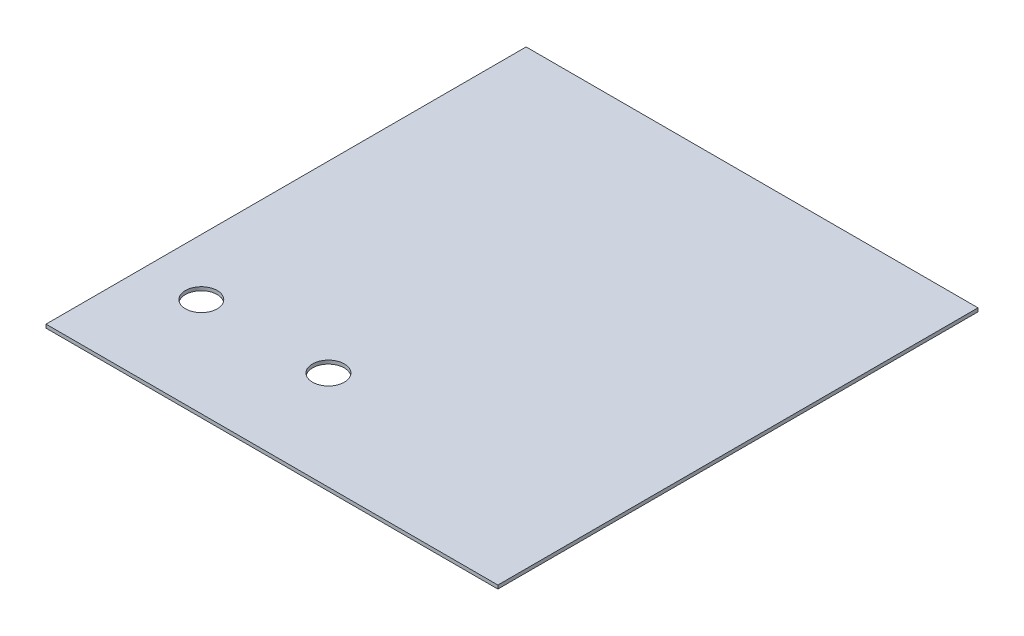
ISO-10303-21;
HEADER;
FILE_DESCRIPTION(('STEP AP214'),'2;1');
FILE_NAME('part.step','',(''),(''),'','','');
FILE_SCHEMA(('AUTOMOTIVE_DESIGN { 1 0 10303 214 1 1 1 1 }'));
ENDSEC;
DATA;
#1=APPLICATION_CONTEXT('core data for automotive mechanical design processes');
#2=APPLICATION_PROTOCOL_DEFINITION('international standard','automotive_design',2000,#1);
#3=PRODUCT_CONTEXT('',#1,'mechanical');
#4=PRODUCT('Part','Part','',(#3));
#5=PRODUCT_RELATED_PRODUCT_CATEGORY('part','',(#4));
#6=PRODUCT_DEFINITION_FORMATION('','',#4);
#7=PRODUCT_DEFINITION_CONTEXT('part definition',#1,'design');
#8=PRODUCT_DEFINITION('design','',#6,#7);
#9=PRODUCT_DEFINITION_SHAPE('','',#8);
#10=(LENGTH_UNIT() NAMED_UNIT(*) SI_UNIT(.MILLI.,.METRE.));
#11=(NAMED_UNIT(*) PLANE_ANGLE_UNIT() SI_UNIT($,.RADIAN.));
#12=(NAMED_UNIT(*) SI_UNIT($,.STERADIAN.) SOLID_ANGLE_UNIT());
#13=UNCERTAINTY_MEASURE_WITH_UNIT(LENGTH_MEASURE(1.E-05),#10,'distance_accuracy_value','');
#14=(GEOMETRIC_REPRESENTATION_CONTEXT(3) GLOBAL_UNCERTAINTY_ASSIGNED_CONTEXT((#13)) GLOBAL_UNIT_ASSIGNED_CONTEXT((#10,
#11,#12)) REPRESENTATION_CONTEXT('',''));
#15=CARTESIAN_POINT('',(0.,0.,0.));
#16=DIRECTION('',(0.,0.,1.));
#17=DIRECTION('',(1.,0.,0.));
#18=AXIS2_PLACEMENT_3D('',#15,#16,#17);
#19=CARTESIAN_POINT('',(0.,3.175,0.));
#20=DIRECTION('',(1.,0.,0.));
#21=DIRECTION('',(0.,0.,-1.));
#22=AXIS2_PLACEMENT_3D('',#19,#20,#21);
#23=PLANE('',#22);
#24=DIRECTION('',(0.,0.,1.));
#25=VECTOR('',#24,1.);
#26=CARTESIAN_POINT('',(0.,0.,0.));
#27=LINE('',#26,#25);
#28=CARTESIAN_POINT('',(0.,0.,-431.8));
#29=VERTEX_POINT('',#28);
#30=CARTESIAN_POINT('',(0.,0.,0.));
#31=VERTEX_POINT('',#30);
#32=EDGE_CURVE('E107',#29,#31,#27,.T.);
#33=ORIENTED_EDGE('',*,*,#32,.T.);
#34=DIRECTION('',(0.,-1.,0.));
#35=VECTOR('',#34,1.);
#36=CARTESIAN_POINT('',(0.,3.175,0.));
#37=LINE('',#36,#35);
#38=CARTESIAN_POINT('',(0.,3.175,0.));
#39=VERTEX_POINT('',#38);
#40=EDGE_CURVE('E11',#39,#31,#37,.T.);
#41=ORIENTED_EDGE('',*,*,#40,.F.);
#42=DIRECTION('',(0.,0.,1.));
#43=VECTOR('',#42,1.);
#44=CARTESIAN_POINT('',(0.,3.175,0.));
#45=LINE('',#44,#43);
#46=CARTESIAN_POINT('',(0.,3.175,-431.8));
#47=VERTEX_POINT('',#46);
#48=EDGE_CURVE('E91',#47,#39,#45,.T.);
#49=ORIENTED_EDGE('',*,*,#48,.F.);
#50=DIRECTION('',(0.,-1.,0.));
#51=VECTOR('',#50,1.);
#52=CARTESIAN_POINT('',(0.,3.175,-431.8));
#53=LINE('',#52,#51);
#54=EDGE_CURVE('E103',#47,#29,#53,.T.);
#55=ORIENTED_EDGE('',*,*,#54,.T.);
#56=EDGE_LOOP('',(#33,#41,#49,#55));
#57=FACE_BOUND('',#56,.T.);
#58=ADVANCED_FACE('F39',(#57),#23,.F.);
#59=CARTESIAN_POINT('',(0.,3.175,0.));
#60=DIRECTION('',(0.,0.,-1.));
#61=DIRECTION('',(-1.,0.,0.));
#62=AXIS2_PLACEMENT_3D('',#59,#60,#61);
#63=PLANE('',#62);
#64=DIRECTION('',(1.,0.,0.));
#65=VECTOR('',#64,1.);
#66=CARTESIAN_POINT('',(0.,0.,0.));
#67=LINE('',#66,#65);
#68=CARTESIAN_POINT('',(406.4,0.,0.));
#69=VERTEX_POINT('',#68);
#70=EDGE_CURVE('E96',#31,#69,#67,.T.);
#71=ORIENTED_EDGE('',*,*,#70,.T.);
#72=DIRECTION('',(0.,-1.,0.));
#73=VECTOR('',#72,1.);
#74=CARTESIAN_POINT('',(406.4,3.175,0.));
#75=LINE('',#74,#73);
#76=CARTESIAN_POINT('',(406.4,3.175,0.));
#77=VERTEX_POINT('',#76);
#78=EDGE_CURVE('E48',#77,#69,#75,.T.);
#79=ORIENTED_EDGE('',*,*,#78,.F.);
#80=DIRECTION('',(1.,0.,0.));
#81=VECTOR('',#80,1.);
#82=CARTESIAN_POINT('',(0.,3.175,0.));
#83=LINE('',#82,#81);
#84=EDGE_CURVE('E86',#39,#77,#83,.T.);
#85=ORIENTED_EDGE('',*,*,#84,.F.);
#86=ORIENTED_EDGE('',*,*,#40,.T.);
#87=EDGE_LOOP('',(#71,#79,#85,#86));
#88=FACE_BOUND('',#87,.T.);
#89=ADVANCED_FACE('F95',(#88),#63,.F.);
#90=CARTESIAN_POINT('',(406.4,3.175,0.));
#91=DIRECTION('',(-1.,0.,0.));
#92=DIRECTION('',(0.,0.,1.));
#93=AXIS2_PLACEMENT_3D('',#90,#91,#92);
#94=PLANE('',#93);
#95=DIRECTION('',(0.,0.,-1.));
#96=VECTOR('',#95,1.);
#97=CARTESIAN_POINT('',(406.4,0.,0.));
#98=LINE('',#97,#96);
#99=CARTESIAN_POINT('',(406.4,0.,-431.8));
#100=VERTEX_POINT('',#99);
#101=EDGE_CURVE('E73',#69,#100,#98,.T.);
#102=ORIENTED_EDGE('',*,*,#101,.T.);
#103=DIRECTION('',(0.,-1.,0.));
#104=VECTOR('',#103,1.);
#105=CARTESIAN_POINT('',(406.4,3.175,-431.8));
#106=LINE('',#105,#104);
#107=CARTESIAN_POINT('',(406.4,3.175,-431.8));
#108=VERTEX_POINT('',#107);
#109=EDGE_CURVE('E98',#108,#100,#106,.T.);
#110=ORIENTED_EDGE('',*,*,#109,.F.);
#111=DIRECTION('',(0.,0.,-1.));
#112=VECTOR('',#111,1.);
#113=CARTESIAN_POINT('',(406.4,3.175,0.));
#114=LINE('',#113,#112);
#115=EDGE_CURVE('E89',#77,#108,#114,.T.);
#116=ORIENTED_EDGE('',*,*,#115,.F.);
#117=ORIENTED_EDGE('',*,*,#78,.T.);
#118=EDGE_LOOP('',(#102,#110,#116,#117));
#119=FACE_BOUND('',#118,.T.);
#120=ADVANCED_FACE('F99',(#119),#94,.F.);
#121=CARTESIAN_POINT('',(0.,3.175,-431.8));
#122=DIRECTION('',(0.,0.,1.));
#123=DIRECTION('',(1.,0.,0.));
#124=AXIS2_PLACEMENT_3D('',#121,#122,#123);
#125=PLANE('',#124);
#126=DIRECTION('',(-1.,0.,0.));
#127=VECTOR('',#126,1.);
#128=CARTESIAN_POINT('',(0.,0.,-431.8));
#129=LINE('',#128,#127);
#130=EDGE_CURVE('E79',#100,#29,#129,.T.);
#131=ORIENTED_EDGE('',*,*,#130,.T.);
#132=ORIENTED_EDGE('',*,*,#54,.F.);
#133=DIRECTION('',(-1.,0.,0.));
#134=VECTOR('',#133,1.);
#135=CARTESIAN_POINT('',(0.,3.175,-431.8));
#136=LINE('',#135,#134);
#137=EDGE_CURVE('E56',#108,#47,#136,.T.);
#138=ORIENTED_EDGE('',*,*,#137,.F.);
#139=ORIENTED_EDGE('',*,*,#109,.T.);
#140=EDGE_LOOP('',(#131,#132,#138,#139));
#141=FACE_BOUND('',#140,.T.);
#142=ADVANCED_FACE('F121',(#141),#125,.F.);
#143=CARTESIAN_POINT('',(0.,3.175,0.));
#144=DIRECTION('',(0.,-1.,0.));
#145=DIRECTION('',(0.,0.,-1.));
#146=AXIS2_PLACEMENT_3D('',#143,#144,#145);
#147=PLANE('',#146);
#148=CARTESIAN_POINT('',(50.8,3.175,-88.9));
#149=DIRECTION('',(0.,1.,0.));
#150=DIRECTION('',(0.,0.,1.));
#151=AXIS2_PLACEMENT_3D('',#148,#149,#150);
#152=CIRCLE('',#151,14.2875);
#153=CARTESIAN_POINT('',(50.8,3.175,-74.6125));
#154=VERTEX_POINT('',#153);
#155=EDGE_CURVE('E136',#154,#154,#152,.T.);
#156=ORIENTED_EDGE('',*,*,#155,.F.);
#157=EDGE_LOOP('',(#156));
#158=FACE_BOUND('',#157,.T.);
#159=CARTESIAN_POINT('',(165.1,3.175,-88.9));
#160=DIRECTION('',(0.,1.,0.));
#161=DIRECTION('',(0.,0.,1.));
#162=AXIS2_PLACEMENT_3D('',#159,#160,#161);
#163=CIRCLE('',#162,14.2875);
#164=CARTESIAN_POINT('',(165.1,3.175,-74.6125));
#165=VERTEX_POINT('',#164);
#166=EDGE_CURVE('E128',#165,#165,#163,.T.);
#167=ORIENTED_EDGE('',*,*,#166,.F.);
#168=EDGE_LOOP('',(#167));
#169=FACE_BOUND('',#168,.T.);
#170=ORIENTED_EDGE('',*,*,#48,.T.);
#171=ORIENTED_EDGE('',*,*,#84,.T.);
#172=ORIENTED_EDGE('',*,*,#115,.T.);
#173=ORIENTED_EDGE('',*,*,#137,.T.);
#174=EDGE_LOOP('',(#170,#171,#172,#173));
#175=FACE_BOUND('',#174,.T.);
#176=ADVANCED_FACE('F87',(#158,#169,#175),#147,.F.);
#177=CARTESIAN_POINT('',(0.,0.,0.));
#178=DIRECTION('',(0.,-1.,0.));
#179=DIRECTION('',(0.,0.,-1.));
#180=AXIS2_PLACEMENT_3D('',#177,#178,#179);
#181=PLANE('',#180);
#182=CARTESIAN_POINT('',(50.8,0.,-88.9));
#183=DIRECTION('',(0.,1.,0.));
#184=DIRECTION('',(0.,0.,1.));
#185=AXIS2_PLACEMENT_3D('',#182,#183,#184);
#186=CIRCLE('',#185,14.2875);
#187=CARTESIAN_POINT('',(50.8,0.,-74.6125));
#188=VERTEX_POINT('',#187);
#189=EDGE_CURVE('E111',#188,#188,#186,.T.);
#190=ORIENTED_EDGE('',*,*,#189,.T.);
#191=EDGE_LOOP('',(#190));
#192=FACE_BOUND('',#191,.T.);
#193=CARTESIAN_POINT('',(165.1,0.,-88.9));
#194=DIRECTION('',(0.,1.,0.));
#195=DIRECTION('',(0.,0.,1.));
#196=AXIS2_PLACEMENT_3D('',#193,#194,#195);
#197=CIRCLE('',#196,14.2875);
#198=CARTESIAN_POINT('',(165.1,0.,-74.6125));
#199=VERTEX_POINT('',#198);
#200=EDGE_CURVE('E132',#199,#199,#197,.T.);
#201=ORIENTED_EDGE('',*,*,#200,.T.);
#202=EDGE_LOOP('',(#201));
#203=FACE_BOUND('',#202,.T.);
#204=ORIENTED_EDGE('',*,*,#32,.F.);
#205=ORIENTED_EDGE('',*,*,#130,.F.);
#206=ORIENTED_EDGE('',*,*,#101,.F.);
#207=ORIENTED_EDGE('',*,*,#70,.F.);
#208=EDGE_LOOP('',(#204,#205,#206,#207));
#209=FACE_BOUND('',#208,.T.);
#210=ADVANCED_FACE('F124',(#192,#203,#209),#181,.T.);
#211=CARTESIAN_POINT('',(165.1,0.,-88.9));
#212=DIRECTION('',(0.,1.,0.));
#213=DIRECTION('',(0.,0.,1.));
#214=AXIS2_PLACEMENT_3D('',#211,#212,#213);
#215=CYLINDRICAL_SURFACE('',#214,14.2875);
#216=ORIENTED_EDGE('',*,*,#200,.F.);
#217=EDGE_LOOP('',(#216));
#218=FACE_BOUND('',#217,.T.);
#219=ORIENTED_EDGE('',*,*,#166,.T.);
#220=EDGE_LOOP('',(#219));
#221=FACE_BOUND('',#220,.T.);
#222=ADVANCED_FACE('F149',(#218,#221),#215,.F.);
#223=CARTESIAN_POINT('',(50.8,0.,-88.9));
#224=DIRECTION('',(0.,1.,0.));
#225=DIRECTION('',(0.,0.,1.));
#226=AXIS2_PLACEMENT_3D('',#223,#224,#225);
#227=CYLINDRICAL_SURFACE('',#226,14.2875);
#228=ORIENTED_EDGE('',*,*,#189,.F.);
#229=EDGE_LOOP('',(#228));
#230=FACE_BOUND('',#229,.T.);
#231=ORIENTED_EDGE('',*,*,#155,.T.);
#232=EDGE_LOOP('',(#231));
#233=FACE_BOUND('',#232,.T.);
#234=ADVANCED_FACE('F146',(#230,#233),#227,.F.);
#235=CLOSED_SHELL('',(#58,#89,#120,#142,#176,#210,#222,#234));
#236=MANIFOLD_SOLID_BREP('B2',#235);
#237=ADVANCED_BREP_SHAPE_REPRESENTATION('',(#18,#236),#14);
#238=SHAPE_DEFINITION_REPRESENTATION(#9,#237);
ENDSEC;
END-ISO-10303-21;
